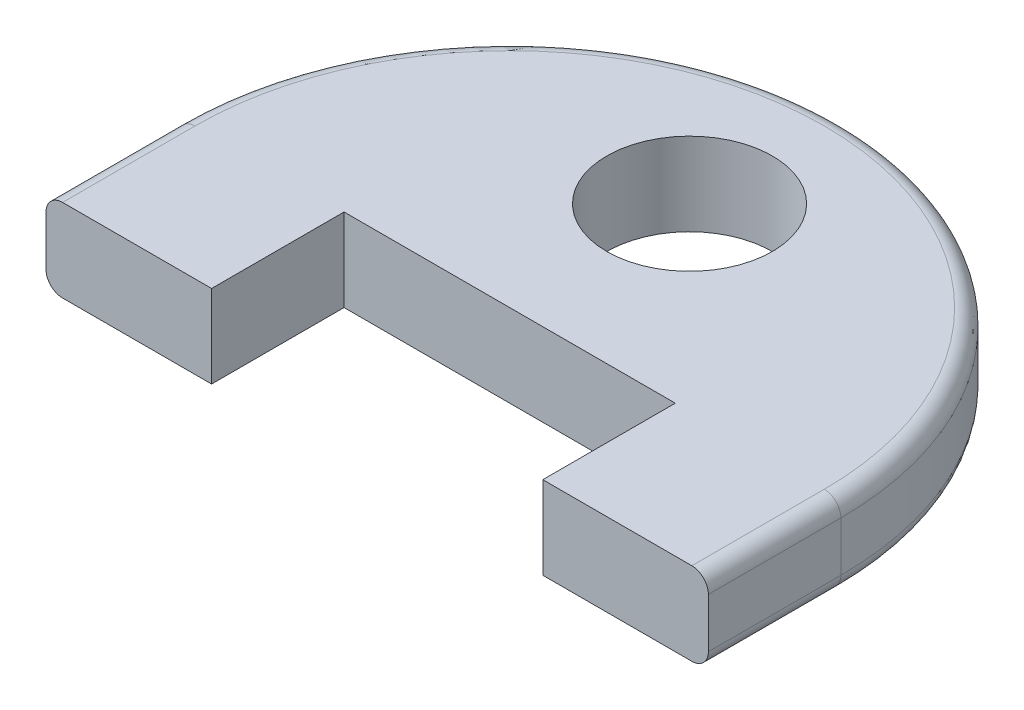
ISO-10303-21;
HEADER;
FILE_DESCRIPTION(('STEP AP214'),'2;1');
FILE_NAME('part.step','',(''),(''),'','','');
FILE_SCHEMA(('AUTOMOTIVE_DESIGN { 1 0 10303 214 1 1 1 1 }'));
ENDSEC;
DATA;
#1=APPLICATION_CONTEXT('core data for automotive mechanical design processes');
#2=APPLICATION_PROTOCOL_DEFINITION('international standard','automotive_design',2000,#1);
#3=PRODUCT_CONTEXT('',#1,'mechanical');
#4=PRODUCT('Part','Part','',(#3));
#5=PRODUCT_RELATED_PRODUCT_CATEGORY('part','',(#4));
#6=PRODUCT_DEFINITION_FORMATION('','',#4);
#7=PRODUCT_DEFINITION_CONTEXT('part definition',#1,'design');
#8=PRODUCT_DEFINITION('design','',#6,#7);
#9=PRODUCT_DEFINITION_SHAPE('','',#8);
#10=(LENGTH_UNIT() NAMED_UNIT(*) SI_UNIT(.MILLI.,.METRE.));
#11=(NAMED_UNIT(*) PLANE_ANGLE_UNIT() SI_UNIT($,.RADIAN.));
#12=(NAMED_UNIT(*) SI_UNIT($,.STERADIAN.) SOLID_ANGLE_UNIT());
#13=UNCERTAINTY_MEASURE_WITH_UNIT(LENGTH_MEASURE(1.E-05),#10,'distance_accuracy_value','');
#14=(GEOMETRIC_REPRESENTATION_CONTEXT(3) GLOBAL_UNCERTAINTY_ASSIGNED_CONTEXT((#13)) GLOBAL_UNIT_ASSIGNED_CONTEXT((#10,
#11,#12)) REPRESENTATION_CONTEXT('',''));
#15=CARTESIAN_POINT('',(0.,0.,0.));
#16=DIRECTION('',(0.,0.,1.));
#17=DIRECTION('',(1.,0.,0.));
#18=AXIS2_PLACEMENT_3D('',#15,#16,#17);
#19=CARTESIAN_POINT('',(0.,6.35,0.));
#20=DIRECTION('',(0.,-1.,0.));
#21=DIRECTION('',(0.,0.,-1.));
#22=AXIS2_PLACEMENT_3D('',#19,#20,#21);
#23=CYLINDRICAL_SURFACE('',#22,25.4);
#24=DIRECTION('',(0.,-1.,0.));
#25=VECTOR('',#24,1.);
#26=CARTESIAN_POINT('',(25.4,6.35,0.));
#27=LINE('',#26,#25);
#28=CARTESIAN_POINT('',(25.4,5.08,0.));
#29=VERTEX_POINT('',#28);
#30=CARTESIAN_POINT('',(25.4,1.27,0.));
#31=VERTEX_POINT('',#30);
#32=EDGE_CURVE('E157',#29,#31,#27,.T.);
#33=ORIENTED_EDGE('',*,*,#32,.T.);
#34=CARTESIAN_POINT('',(0.,1.27,0.));
#35=DIRECTION('',(0.,-1.,0.));
#36=DIRECTION('',(0.,0.,-1.));
#37=AXIS2_PLACEMENT_3D('',#34,#35,#36);
#38=CIRCLE('',#37,25.4);
#39=CARTESIAN_POINT('',(-25.4,1.27,0.));
#40=VERTEX_POINT('',#39);
#41=EDGE_CURVE('E11',#31,#40,#38,.F.);
#42=ORIENTED_EDGE('',*,*,#41,.T.);
#43=DIRECTION('',(0.,-1.,0.));
#44=VECTOR('',#43,1.);
#45=CARTESIAN_POINT('',(-25.4,6.35,0.));
#46=LINE('',#45,#44);
#47=CARTESIAN_POINT('',(-25.4,5.08,0.));
#48=VERTEX_POINT('',#47);
#49=EDGE_CURVE('E181',#48,#40,#46,.T.);
#50=ORIENTED_EDGE('',*,*,#49,.F.);
#51=CARTESIAN_POINT('',(0.,5.08,0.));
#52=DIRECTION('',(0.,-1.,0.));
#53=DIRECTION('',(0.,0.,-1.));
#54=AXIS2_PLACEMENT_3D('',#51,#52,#53);
#55=CIRCLE('',#54,25.4);
#56=EDGE_CURVE('E41',#48,#29,#55,.T.);
#57=ORIENTED_EDGE('',*,*,#56,.T.);
#58=EDGE_LOOP('',(#33,#42,#50,#57));
#59=FACE_BOUND('',#58,.T.);
#60=ADVANCED_FACE('F32',(#59),#23,.T.);
#61=CARTESIAN_POINT('',(-25.4,6.35,10.16));
#62=DIRECTION('',(1.,0.,0.));
#63=DIRECTION('',(0.,0.,-1.));
#64=AXIS2_PLACEMENT_3D('',#61,#62,#63);
#65=PLANE('',#64);
#66=ORIENTED_EDGE('',*,*,#49,.T.);
#67=DIRECTION('',(0.,0.,1.));
#68=VECTOR('',#67,1.);
#69=CARTESIAN_POINT('',(-25.4,1.27,10.16));
#70=LINE('',#69,#68);
#71=CARTESIAN_POINT('',(-25.4,1.27,10.16));
#72=VERTEX_POINT('',#71);
#73=EDGE_CURVE('E201',#40,#72,#70,.T.);
#74=ORIENTED_EDGE('',*,*,#73,.T.);
#75=DIRECTION('',(0.,-1.,0.));
#76=VECTOR('',#75,1.);
#77=CARTESIAN_POINT('',(-25.4,6.35,10.16));
#78=LINE('',#77,#76);
#79=CARTESIAN_POINT('',(-25.4,5.08,10.16));
#80=VERTEX_POINT('',#79);
#81=EDGE_CURVE('E142',#80,#72,#78,.T.);
#82=ORIENTED_EDGE('',*,*,#81,.F.);
#83=DIRECTION('',(0.,0.,1.));
#84=VECTOR('',#83,1.);
#85=CARTESIAN_POINT('',(-25.4,5.08,10.16));
#86=LINE('',#85,#84);
#87=EDGE_CURVE('E199',#80,#48,#86,.F.);
#88=ORIENTED_EDGE('',*,*,#87,.T.);
#89=EDGE_LOOP('',(#66,#74,#82,#88));
#90=FACE_BOUND('',#89,.T.);
#91=ADVANCED_FACE('F242',(#90),#65,.F.);
#92=CARTESIAN_POINT('',(-25.4,6.35,10.16));
#93=DIRECTION('',(0.,0.,-1.));
#94=DIRECTION('',(-1.,0.,0.));
#95=AXIS2_PLACEMENT_3D('',#92,#93,#94);
#96=PLANE('',#95);
#97=ORIENTED_EDGE('',*,*,#81,.T.);
#98=CARTESIAN_POINT('',(-24.13,1.27,10.16));
#99=DIRECTION('',(0.,0.,-1.));
#100=DIRECTION('',(-1.,0.,0.));
#101=AXIS2_PLACEMENT_3D('',#98,#99,#100);
#102=CIRCLE('',#101,1.27);
#103=CARTESIAN_POINT('',(-24.13,0.,10.16));
#104=VERTEX_POINT('',#103);
#105=EDGE_CURVE('E205',#72,#104,#102,.F.);
#106=ORIENTED_EDGE('',*,*,#105,.T.);
#107=DIRECTION('',(1.,0.,0.));
#108=VECTOR('',#107,1.);
#109=CARTESIAN_POINT('',(-25.4,0.,10.16));
#110=LINE('',#109,#108);
#111=CARTESIAN_POINT('',(-12.7,0.,10.16));
#112=VERTEX_POINT('',#111);
#113=EDGE_CURVE('E139',#104,#112,#110,.T.);
#114=ORIENTED_EDGE('',*,*,#113,.T.);
#115=DIRECTION('',(0.,-1.,0.));
#116=VECTOR('',#115,1.);
#117=CARTESIAN_POINT('',(-12.7,6.35,10.16));
#118=LINE('',#117,#116);
#119=CARTESIAN_POINT('',(-12.7,6.35,10.16));
#120=VERTEX_POINT('',#119);
#121=EDGE_CURVE('E135',#120,#112,#118,.T.);
#122=ORIENTED_EDGE('',*,*,#121,.F.);
#123=DIRECTION('',(1.,0.,0.));
#124=VECTOR('',#123,1.);
#125=CARTESIAN_POINT('',(-25.4,6.35,10.16));
#126=LINE('',#125,#124);
#127=CARTESIAN_POINT('',(-24.13,6.35,10.16));
#128=VERTEX_POINT('',#127);
#129=EDGE_CURVE('E122',#128,#120,#126,.T.);
#130=ORIENTED_EDGE('',*,*,#129,.F.);
#131=CARTESIAN_POINT('',(-24.13,5.08,10.16));
#132=DIRECTION('',(0.,0.,-1.));
#133=DIRECTION('',(-1.,0.,0.));
#134=AXIS2_PLACEMENT_3D('',#131,#132,#133);
#135=CIRCLE('',#134,1.27);
#136=EDGE_CURVE('E203',#128,#80,#135,.F.);
#137=ORIENTED_EDGE('',*,*,#136,.T.);
#138=EDGE_LOOP('',(#97,#106,#114,#122,#130,#137));
#139=FACE_BOUND('',#138,.T.);
#140=ADVANCED_FACE('F137',(#139),#96,.F.);
#141=CARTESIAN_POINT('',(-12.7,6.35,10.16));
#142=DIRECTION('',(-1.,0.,0.));
#143=DIRECTION('',(0.,0.,1.));
#144=AXIS2_PLACEMENT_3D('',#141,#142,#143);
#145=PLANE('',#144);
#146=DIRECTION('',(0.,0.,-1.));
#147=VECTOR('',#146,1.);
#148=CARTESIAN_POINT('',(-12.7,0.,10.16));
#149=LINE('',#148,#147);
#150=CARTESIAN_POINT('',(-12.7,0.,0.));
#151=VERTEX_POINT('',#150);
#152=EDGE_CURVE('E159',#112,#151,#149,.T.);
#153=ORIENTED_EDGE('',*,*,#152,.T.);
#154=DIRECTION('',(0.,-1.,0.));
#155=VECTOR('',#154,1.);
#156=CARTESIAN_POINT('',(-12.7,6.35,0.));
#157=LINE('',#156,#155);
#158=CARTESIAN_POINT('',(-12.7,6.35,0.));
#159=VERTEX_POINT('',#158);
#160=EDGE_CURVE('E143',#159,#151,#157,.T.);
#161=ORIENTED_EDGE('',*,*,#160,.F.);
#162=DIRECTION('',(0.,0.,-1.));
#163=VECTOR('',#162,1.);
#164=CARTESIAN_POINT('',(-12.7,6.35,10.16));
#165=LINE('',#164,#163);
#166=EDGE_CURVE('E127',#120,#159,#165,.T.);
#167=ORIENTED_EDGE('',*,*,#166,.F.);
#168=ORIENTED_EDGE('',*,*,#121,.T.);
#169=EDGE_LOOP('',(#153,#161,#167,#168));
#170=FACE_BOUND('',#169,.T.);
#171=ADVANCED_FACE('F145',(#170),#145,.F.);
#172=CARTESIAN_POINT('',(-12.7,6.35,0.));
#173=DIRECTION('',(0.,0.,-1.));
#174=DIRECTION('',(-1.,0.,0.));
#175=AXIS2_PLACEMENT_3D('',#172,#173,#174);
#176=PLANE('',#175);
#177=DIRECTION('',(1.,0.,0.));
#178=VECTOR('',#177,1.);
#179=CARTESIAN_POINT('',(-12.7,0.,0.));
#180=LINE('',#179,#178);
#181=CARTESIAN_POINT('',(12.7,0.,0.));
#182=VERTEX_POINT('',#181);
#183=EDGE_CURVE('E162',#151,#182,#180,.T.);
#184=ORIENTED_EDGE('',*,*,#183,.T.);
#185=DIRECTION('',(0.,-1.,0.));
#186=VECTOR('',#185,1.);
#187=CARTESIAN_POINT('',(12.7,6.35,0.));
#188=LINE('',#187,#186);
#189=CARTESIAN_POINT('',(12.7,6.35,0.));
#190=VERTEX_POINT('',#189);
#191=EDGE_CURVE('E176',#190,#182,#188,.T.);
#192=ORIENTED_EDGE('',*,*,#191,.F.);
#193=DIRECTION('',(1.,0.,0.));
#194=VECTOR('',#193,1.);
#195=CARTESIAN_POINT('',(-12.7,6.35,0.));
#196=LINE('',#195,#194);
#197=EDGE_CURVE('E148',#159,#190,#196,.T.);
#198=ORIENTED_EDGE('',*,*,#197,.F.);
#199=ORIENTED_EDGE('',*,*,#160,.T.);
#200=EDGE_LOOP('',(#184,#192,#198,#199));
#201=FACE_BOUND('',#200,.T.);
#202=ADVANCED_FACE('F302',(#201),#176,.F.);
#203=CARTESIAN_POINT('',(12.7,6.35,10.16));
#204=DIRECTION('',(1.,0.,0.));
#205=DIRECTION('',(0.,0.,-1.));
#206=AXIS2_PLACEMENT_3D('',#203,#204,#205);
#207=PLANE('',#206);
#208=DIRECTION('',(0.,0.,1.));
#209=VECTOR('',#208,1.);
#210=CARTESIAN_POINT('',(12.7,0.,10.16));
#211=LINE('',#210,#209);
#212=CARTESIAN_POINT('',(12.7,0.,10.16));
#213=VERTEX_POINT('',#212);
#214=EDGE_CURVE('E164',#182,#213,#211,.T.);
#215=ORIENTED_EDGE('',*,*,#214,.T.);
#216=DIRECTION('',(0.,-1.,0.));
#217=VECTOR('',#216,1.);
#218=CARTESIAN_POINT('',(12.7,6.35,10.16));
#219=LINE('',#218,#217);
#220=CARTESIAN_POINT('',(12.7,6.35,10.16));
#221=VERTEX_POINT('',#220);
#222=EDGE_CURVE('E173',#221,#213,#219,.T.);
#223=ORIENTED_EDGE('',*,*,#222,.F.);
#224=DIRECTION('',(0.,0.,1.));
#225=VECTOR('',#224,1.);
#226=CARTESIAN_POINT('',(12.7,6.35,10.16));
#227=LINE('',#226,#225);
#228=EDGE_CURVE('E150',#190,#221,#227,.T.);
#229=ORIENTED_EDGE('',*,*,#228,.F.);
#230=ORIENTED_EDGE('',*,*,#191,.T.);
#231=EDGE_LOOP('',(#215,#223,#229,#230));
#232=FACE_BOUND('',#231,.T.);
#233=ADVANCED_FACE('F298',(#232),#207,.F.);
#234=CARTESIAN_POINT('',(12.7,6.35,10.16));
#235=DIRECTION('',(0.,0.,-1.));
#236=DIRECTION('',(-1.,0.,0.));
#237=AXIS2_PLACEMENT_3D('',#234,#235,#236);
#238=PLANE('',#237);
#239=DIRECTION('',(1.,0.,0.));
#240=VECTOR('',#239,1.);
#241=CARTESIAN_POINT('',(12.7,0.,10.16));
#242=LINE('',#241,#240);
#243=CARTESIAN_POINT('',(24.13,0.,10.16));
#244=VERTEX_POINT('',#243);
#245=EDGE_CURVE('E132',#213,#244,#242,.T.);
#246=ORIENTED_EDGE('',*,*,#245,.T.);
#247=CARTESIAN_POINT('',(24.13,1.27,10.16));
#248=DIRECTION('',(0.,0.,-1.));
#249=DIRECTION('',(-1.,0.,0.));
#250=AXIS2_PLACEMENT_3D('',#247,#248,#249);
#251=CIRCLE('',#250,1.27);
#252=CARTESIAN_POINT('',(25.4,1.27,10.16));
#253=VERTEX_POINT('',#252);
#254=EDGE_CURVE('E197',#244,#253,#251,.F.);
#255=ORIENTED_EDGE('',*,*,#254,.T.);
#256=DIRECTION('',(0.,-1.,0.));
#257=VECTOR('',#256,1.);
#258=CARTESIAN_POINT('',(25.4,6.35,10.16));
#259=LINE('',#258,#257);
#260=CARTESIAN_POINT('',(25.4,5.08,10.16));
#261=VERTEX_POINT('',#260);
#262=EDGE_CURVE('E170',#261,#253,#259,.T.);
#263=ORIENTED_EDGE('',*,*,#262,.F.);
#264=CARTESIAN_POINT('',(24.13,5.08,10.16));
#265=DIRECTION('',(0.,0.,-1.));
#266=DIRECTION('',(-1.,0.,0.));
#267=AXIS2_PLACEMENT_3D('',#264,#265,#266);
#268=CIRCLE('',#267,1.27);
#269=CARTESIAN_POINT('',(24.13,6.35,10.16));
#270=VERTEX_POINT('',#269);
#271=EDGE_CURVE('E195',#261,#270,#268,.F.);
#272=ORIENTED_EDGE('',*,*,#271,.T.);
#273=DIRECTION('',(1.,0.,0.));
#274=VECTOR('',#273,1.);
#275=CARTESIAN_POINT('',(12.7,6.35,10.16));
#276=LINE('',#275,#274);
#277=EDGE_CURVE('E155',#221,#270,#276,.T.);
#278=ORIENTED_EDGE('',*,*,#277,.F.);
#279=ORIENTED_EDGE('',*,*,#222,.T.);
#280=EDGE_LOOP('',(#246,#255,#263,#272,#278,#279));
#281=FACE_BOUND('',#280,.T.);
#282=ADVANCED_FACE('F237',(#281),#238,.F.);
#283=CARTESIAN_POINT('',(25.4,6.35,10.16));
#284=DIRECTION('',(-1.,0.,0.));
#285=DIRECTION('',(0.,0.,1.));
#286=AXIS2_PLACEMENT_3D('',#283,#284,#285);
#287=PLANE('',#286);
#288=ORIENTED_EDGE('',*,*,#262,.T.);
#289=DIRECTION('',(0.,0.,-1.));
#290=VECTOR('',#289,1.);
#291=CARTESIAN_POINT('',(25.4,1.27,0.));
#292=LINE('',#291,#290);
#293=EDGE_CURVE('E186',#253,#31,#292,.T.);
#294=ORIENTED_EDGE('',*,*,#293,.T.);
#295=ORIENTED_EDGE('',*,*,#32,.F.);
#296=DIRECTION('',(0.,0.,-1.));
#297=VECTOR('',#296,1.);
#298=CARTESIAN_POINT('',(25.4,5.08,10.16));
#299=LINE('',#298,#297);
#300=EDGE_CURVE('E184',#29,#261,#299,.F.);
#301=ORIENTED_EDGE('',*,*,#300,.T.);
#302=EDGE_LOOP('',(#288,#294,#295,#301));
#303=FACE_BOUND('',#302,.T.);
#304=ADVANCED_FACE('F229',(#303),#287,.F.);
#305=CARTESIAN_POINT('',(0.,6.35,0.));
#306=DIRECTION('',(0.,-1.,0.));
#307=DIRECTION('',(0.,0.,-1.));
#308=AXIS2_PLACEMENT_3D('',#305,#306,#307);
#309=PLANE('',#308);
#310=CARTESIAN_POINT('',(0.,6.35,-13.7960823089788));
#311=DIRECTION('',(0.,1.,0.));
#312=DIRECTION('',(0.,0.,1.));
#313=AXIS2_PLACEMENT_3D('',#310,#311,#312);
#314=CIRCLE('',#313,6.35);
#315=CARTESIAN_POINT('',(0.,6.35,-7.44608230897881));
#316=VERTEX_POINT('',#315);
#317=EDGE_CURVE('E218',#316,#316,#314,.T.);
#318=ORIENTED_EDGE('',*,*,#317,.F.);
#319=EDGE_LOOP('',(#318));
#320=FACE_BOUND('',#319,.T.);
#321=ORIENTED_EDGE('',*,*,#277,.T.);
#322=DIRECTION('',(0.,0.,-1.));
#323=VECTOR('',#322,1.);
#324=CARTESIAN_POINT('',(24.13,6.35,0.));
#325=LINE('',#324,#323);
#326=CARTESIAN_POINT('',(24.13,6.35,0.));
#327=VERTEX_POINT('',#326);
#328=EDGE_CURVE('E209',#270,#327,#325,.T.);
#329=ORIENTED_EDGE('',*,*,#328,.T.);
#330=CARTESIAN_POINT('',(0.,6.35,0.));
#331=DIRECTION('',(0.,-1.,0.));
#332=DIRECTION('',(0.,0.,-1.));
#333=AXIS2_PLACEMENT_3D('',#330,#331,#332);
#334=CIRCLE('',#333,24.13);
#335=CARTESIAN_POINT('',(-24.13,6.35,0.));
#336=VERTEX_POINT('',#335);
#337=EDGE_CURVE('E49',#327,#336,#334,.F.);
#338=ORIENTED_EDGE('',*,*,#337,.T.);
#339=DIRECTION('',(0.,0.,1.));
#340=VECTOR('',#339,1.);
#341=CARTESIAN_POINT('',(-24.13,6.35,0.));
#342=LINE('',#341,#340);
#343=EDGE_CURVE('E129',#336,#128,#342,.T.);
#344=ORIENTED_EDGE('',*,*,#343,.T.);
#345=ORIENTED_EDGE('',*,*,#129,.T.);
#346=ORIENTED_EDGE('',*,*,#166,.T.);
#347=ORIENTED_EDGE('',*,*,#197,.T.);
#348=ORIENTED_EDGE('',*,*,#228,.T.);
#349=EDGE_LOOP('',(#321,#329,#338,#344,#345,#346,#347,#348));
#350=FACE_BOUND('',#349,.T.);
#351=ADVANCED_FACE('F125',(#320,#350),#309,.F.);
#352=CARTESIAN_POINT('',(0.,0.,0.));
#353=DIRECTION('',(0.,-1.,0.));
#354=DIRECTION('',(0.,0.,-1.));
#355=AXIS2_PLACEMENT_3D('',#352,#353,#354);
#356=PLANE('',#355);
#357=CARTESIAN_POINT('',(0.,0.,-13.7960823089788));
#358=DIRECTION('',(0.,1.,0.));
#359=DIRECTION('',(0.,0.,1.));
#360=AXIS2_PLACEMENT_3D('',#357,#358,#359);
#361=CIRCLE('',#360,6.35);
#362=CARTESIAN_POINT('',(0.,0.,-7.44608230897881));
#363=VERTEX_POINT('',#362);
#364=EDGE_CURVE('E215',#363,#363,#361,.T.);
#365=ORIENTED_EDGE('',*,*,#364,.T.);
#366=EDGE_LOOP('',(#365));
#367=FACE_BOUND('',#366,.T.);
#368=CARTESIAN_POINT('',(0.,0.,0.));
#369=DIRECTION('',(0.,-1.,0.));
#370=DIRECTION('',(0.,0.,-1.));
#371=AXIS2_PLACEMENT_3D('',#368,#369,#370);
#372=CIRCLE('',#371,24.13);
#373=CARTESIAN_POINT('',(-24.13,0.,0.));
#374=VERTEX_POINT('',#373);
#375=CARTESIAN_POINT('',(24.13,0.,0.));
#376=VERTEX_POINT('',#375);
#377=EDGE_CURVE('E189',#374,#376,#372,.T.);
#378=ORIENTED_EDGE('',*,*,#377,.T.);
#379=DIRECTION('',(0.,0.,-1.));
#380=VECTOR('',#379,1.);
#381=CARTESIAN_POINT('',(24.13,0.,10.16));
#382=LINE('',#381,#380);
#383=EDGE_CURVE('E193',#376,#244,#382,.F.);
#384=ORIENTED_EDGE('',*,*,#383,.T.);
#385=ORIENTED_EDGE('',*,*,#245,.F.);
#386=ORIENTED_EDGE('',*,*,#214,.F.);
#387=ORIENTED_EDGE('',*,*,#183,.F.);
#388=ORIENTED_EDGE('',*,*,#152,.F.);
#389=ORIENTED_EDGE('',*,*,#113,.F.);
#390=DIRECTION('',(0.,0.,1.));
#391=VECTOR('',#390,1.);
#392=CARTESIAN_POINT('',(-24.13,0.,0.));
#393=LINE('',#392,#391);
#394=EDGE_CURVE('E191',#104,#374,#393,.F.);
#395=ORIENTED_EDGE('',*,*,#394,.T.);
#396=EDGE_LOOP('',(#378,#384,#385,#386,#387,#388,#389,#395));
#397=FACE_BOUND('',#396,.T.);
#398=ADVANCED_FACE('F228',(#367,#397),#356,.T.);
#399=CARTESIAN_POINT('',(-24.13,1.27,10.16));
#400=DIRECTION('',(0.,0.,-1.));
#401=DIRECTION('',(-1.,0.,0.));
#402=AXIS2_PLACEMENT_3D('',#399,#400,#401);
#403=CYLINDRICAL_SURFACE('',#402,1.27);
#404=ORIENTED_EDGE('',*,*,#105,.F.);
#405=ORIENTED_EDGE('',*,*,#73,.F.);
#406=CARTESIAN_POINT('',(-24.13,1.27,0.));
#407=DIRECTION('',(0.,0.,-1.));
#408=DIRECTION('',(-1.,0.,0.));
#409=AXIS2_PLACEMENT_3D('',#406,#407,#408);
#410=CIRCLE('',#409,1.27);
#411=EDGE_CURVE('E160',#374,#40,#410,.T.);
#412=ORIENTED_EDGE('',*,*,#411,.F.);
#413=ORIENTED_EDGE('',*,*,#394,.F.);
#414=EDGE_LOOP('',(#404,#405,#412,#413));
#415=FACE_BOUND('',#414,.T.);
#416=ADVANCED_FACE('F235',(#415),#403,.T.);
#417=CARTESIAN_POINT('',(0.,1.27,0.));
#418=DIRECTION('',(0.,-1.,0.));
#419=DIRECTION('',(0.,0.,-1.));
#420=AXIS2_PLACEMENT_3D('',#417,#418,#419);
#421=TOROIDAL_SURFACE('',#420,24.13,1.27);
#422=ORIENTED_EDGE('',*,*,#411,.T.);
#423=ORIENTED_EDGE('',*,*,#41,.F.);
#424=CARTESIAN_POINT('',(24.13,1.27,0.));
#425=DIRECTION('',(0.,0.,1.));
#426=DIRECTION('',(1.,0.,0.));
#427=AXIS2_PLACEMENT_3D('',#424,#425,#426);
#428=CIRCLE('',#427,1.27);
#429=EDGE_CURVE('E212',#376,#31,#428,.T.);
#430=ORIENTED_EDGE('',*,*,#429,.F.);
#431=ORIENTED_EDGE('',*,*,#377,.F.);
#432=EDGE_LOOP('',(#422,#423,#430,#431));
#433=FACE_BOUND('',#432,.T.);
#434=ADVANCED_FACE('F255',(#433),#421,.T.);
#435=CARTESIAN_POINT('',(24.13,1.27,10.16));
#436=DIRECTION('',(0.,0.,1.));
#437=DIRECTION('',(1.,0.,0.));
#438=AXIS2_PLACEMENT_3D('',#435,#436,#437);
#439=CYLINDRICAL_SURFACE('',#438,1.27);
#440=ORIENTED_EDGE('',*,*,#254,.F.);
#441=ORIENTED_EDGE('',*,*,#383,.F.);
#442=ORIENTED_EDGE('',*,*,#429,.T.);
#443=ORIENTED_EDGE('',*,*,#293,.F.);
#444=EDGE_LOOP('',(#440,#441,#442,#443));
#445=FACE_BOUND('',#444,.T.);
#446=ADVANCED_FACE('F252',(#445),#439,.T.);
#447=CARTESIAN_POINT('',(-24.13,5.08,0.));
#448=DIRECTION('',(0.,0.,1.));
#449=DIRECTION('',(1.,0.,0.));
#450=AXIS2_PLACEMENT_3D('',#447,#448,#449);
#451=CYLINDRICAL_SURFACE('',#450,1.27);
#452=ORIENTED_EDGE('',*,*,#136,.F.);
#453=ORIENTED_EDGE('',*,*,#343,.F.);
#454=CARTESIAN_POINT('',(-24.13,5.08,0.));
#455=DIRECTION('',(0.,0.,-1.));
#456=DIRECTION('',(-1.,0.,0.));
#457=AXIS2_PLACEMENT_3D('',#454,#455,#456);
#458=CIRCLE('',#457,1.27);
#459=EDGE_CURVE('E36',#48,#336,#458,.T.);
#460=ORIENTED_EDGE('',*,*,#459,.F.);
#461=ORIENTED_EDGE('',*,*,#87,.F.);
#462=EDGE_LOOP('',(#452,#453,#460,#461));
#463=FACE_BOUND('',#462,.T.);
#464=ADVANCED_FACE('F34',(#463),#451,.T.);
#465=CARTESIAN_POINT('',(0.,5.08,0.));
#466=DIRECTION('',(0.,-1.,0.));
#467=DIRECTION('',(0.,0.,-1.));
#468=AXIS2_PLACEMENT_3D('',#465,#466,#467);
#469=TOROIDAL_SURFACE('',#468,24.13,1.27);
#470=ORIENTED_EDGE('',*,*,#459,.T.);
#471=ORIENTED_EDGE('',*,*,#337,.F.);
#472=CARTESIAN_POINT('',(24.13,5.08,0.));
#473=DIRECTION('',(0.,0.,1.));
#474=DIRECTION('',(1.,0.,0.));
#475=AXIS2_PLACEMENT_3D('',#472,#473,#474);
#476=CIRCLE('',#475,1.27);
#477=EDGE_CURVE('E57',#29,#327,#476,.T.);
#478=ORIENTED_EDGE('',*,*,#477,.F.);
#479=ORIENTED_EDGE('',*,*,#56,.F.);
#480=EDGE_LOOP('',(#470,#471,#478,#479));
#481=FACE_BOUND('',#480,.T.);
#482=ADVANCED_FACE('F265',(#481),#469,.T.);
#483=CARTESIAN_POINT('',(24.13,5.08,0.));
#484=DIRECTION('',(0.,0.,-1.));
#485=DIRECTION('',(-1.,0.,0.));
#486=AXIS2_PLACEMENT_3D('',#483,#484,#485);
#487=CYLINDRICAL_SURFACE('',#486,1.27);
#488=ORIENTED_EDGE('',*,*,#271,.F.);
#489=ORIENTED_EDGE('',*,*,#300,.F.);
#490=ORIENTED_EDGE('',*,*,#477,.T.);
#491=ORIENTED_EDGE('',*,*,#328,.F.);
#492=EDGE_LOOP('',(#488,#489,#490,#491));
#493=FACE_BOUND('',#492,.T.);
#494=ADVANCED_FACE('F263',(#493),#487,.T.);
#495=CARTESIAN_POINT('',(0.,0.,-13.7960823089788));
#496=DIRECTION('',(0.,1.,0.));
#497=DIRECTION('',(0.,0.,1.));
#498=AXIS2_PLACEMENT_3D('',#495,#496,#497);
#499=CYLINDRICAL_SURFACE('',#498,6.35);
#500=ORIENTED_EDGE('',*,*,#364,.F.);
#501=EDGE_LOOP('',(#500));
#502=FACE_BOUND('',#501,.T.);
#503=ORIENTED_EDGE('',*,*,#317,.T.);
#504=EDGE_LOOP('',(#503));
#505=FACE_BOUND('',#504,.T.);
#506=ADVANCED_FACE('F225',(#502,#505),#499,.F.);
#507=CLOSED_SHELL('',(#60,#91,#140,#171,#202,#233,#282,#304,#351,#398,#416,#434,#446,#464,#482,
#494,#506));
#508=MANIFOLD_SOLID_BREP('B2',#507);
#509=ADVANCED_BREP_SHAPE_REPRESENTATION('',(#18,#508),#14);
#510=SHAPE_DEFINITION_REPRESENTATION(#9,#509);
ENDSEC;
END-ISO-10303-21;
